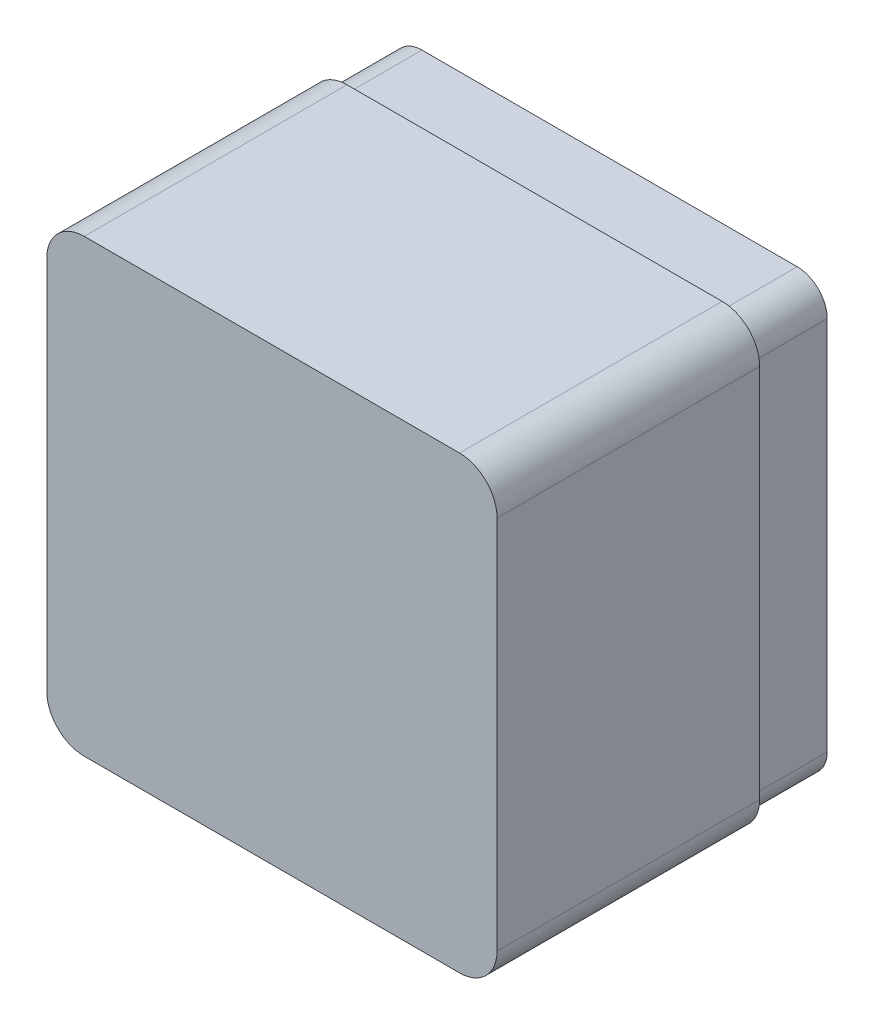
ISO-10303-21;
HEADER;
FILE_DESCRIPTION(('STEP AP214'),'2;1');
FILE_NAME('part.step','',(''),(''),'','','');
FILE_SCHEMA(('AUTOMOTIVE_DESIGN { 1 0 10303 214 1 1 1 1 }'));
ENDSEC;
DATA;
#1=APPLICATION_CONTEXT('core data for automotive mechanical design processes');
#2=APPLICATION_PROTOCOL_DEFINITION('international standard','automotive_design',2000,#1);
#3=PRODUCT_CONTEXT('',#1,'mechanical');
#4=PRODUCT('Part','Part','',(#3));
#5=PRODUCT_RELATED_PRODUCT_CATEGORY('part','',(#4));
#6=PRODUCT_DEFINITION_FORMATION('','',#4);
#7=PRODUCT_DEFINITION_CONTEXT('part definition',#1,'design');
#8=PRODUCT_DEFINITION('design','',#6,#7);
#9=PRODUCT_DEFINITION_SHAPE('','',#8);
#10=(LENGTH_UNIT() NAMED_UNIT(*) SI_UNIT(.MILLI.,.METRE.));
#11=(NAMED_UNIT(*) PLANE_ANGLE_UNIT() SI_UNIT($,.RADIAN.));
#12=(NAMED_UNIT(*) SI_UNIT($,.STERADIAN.) SOLID_ANGLE_UNIT());
#13=UNCERTAINTY_MEASURE_WITH_UNIT(LENGTH_MEASURE(1.E-05),#10,'distance_accuracy_value','');
#14=(GEOMETRIC_REPRESENTATION_CONTEXT(3) GLOBAL_UNCERTAINTY_ASSIGNED_CONTEXT((#13)) GLOBAL_UNIT_ASSIGNED_CONTEXT((#10,
#11,#12)) REPRESENTATION_CONTEXT('',''));
#15=CARTESIAN_POINT('',(0.,0.,0.));
#16=DIRECTION('',(0.,0.,1.));
#17=DIRECTION('',(1.,0.,0.));
#18=AXIS2_PLACEMENT_3D('',#15,#16,#17);
#19=CARTESIAN_POINT('',(0.,0.,0.));
#20=DIRECTION('',(0.,0.,1.));
#21=DIRECTION('',(1.,0.,0.));
#22=AXIS2_PLACEMENT_3D('',#19,#20,#21);
#23=PLANE('',#22);
#24=CARTESIAN_POINT('',(110.,-110.,0.));
#25=DIRECTION('',(0.,0.,1.));
#26=DIRECTION('',(1.,0.,0.));
#27=AXIS2_PLACEMENT_3D('',#24,#25,#26);
#28=CIRCLE('',#27,6.);
#29=CARTESIAN_POINT('',(116.,-110.,0.));
#30=VERTEX_POINT('',#29);
#31=CARTESIAN_POINT('',(110.,-116.,0.));
#32=VERTEX_POINT('',#31);
#33=EDGE_CURVE('E364',#30,#32,#28,.F.);
#34=ORIENTED_EDGE('',*,*,#33,.F.);
#35=DIRECTION('',(0.,1.,0.));
#36=VECTOR('',#35,1.);
#37=CARTESIAN_POINT('',(116.,0.,0.));
#38=LINE('',#37,#36);
#39=CARTESIAN_POINT('',(116.,-10.,0.));
#40=VERTEX_POINT('',#39);
#41=EDGE_CURVE('E389',#30,#40,#38,.T.);
#42=ORIENTED_EDGE('',*,*,#41,.T.);
#43=CARTESIAN_POINT('',(110.,-10.,0.));
#44=DIRECTION('',(0.,0.,1.));
#45=DIRECTION('',(1.,0.,0.));
#46=AXIS2_PLACEMENT_3D('',#43,#44,#45);
#47=CIRCLE('',#46,6.);
#48=CARTESIAN_POINT('',(110.,-4.,0.));
#49=VERTEX_POINT('',#48);
#50=EDGE_CURVE('E368',#49,#40,#47,.F.);
#51=ORIENTED_EDGE('',*,*,#50,.F.);
#52=DIRECTION('',(-1.,0.,0.));
#53=VECTOR('',#52,1.);
#54=CARTESIAN_POINT('',(0.,-4.,0.));
#55=LINE('',#54,#53);
#56=CARTESIAN_POINT('',(10.,-4.,0.));
#57=VERTEX_POINT('',#56);
#58=EDGE_CURVE('E331',#49,#57,#55,.T.);
#59=ORIENTED_EDGE('',*,*,#58,.T.);
#60=CARTESIAN_POINT('',(10.,-10.,0.));
#61=DIRECTION('',(0.,0.,1.));
#62=DIRECTION('',(1.,0.,0.));
#63=AXIS2_PLACEMENT_3D('',#60,#61,#62);
#64=CIRCLE('',#63,6.);
#65=CARTESIAN_POINT('',(4.,-10.,0.));
#66=VERTEX_POINT('',#65);
#67=EDGE_CURVE('E382',#66,#57,#64,.F.);
#68=ORIENTED_EDGE('',*,*,#67,.F.);
#69=DIRECTION('',(0.,-1.,0.));
#70=VECTOR('',#69,1.);
#71=CARTESIAN_POINT('',(4.,0.,0.));
#72=LINE('',#71,#70);
#73=CARTESIAN_POINT('',(4.00000000000001,-110.,0.));
#74=VERTEX_POINT('',#73);
#75=EDGE_CURVE('E320',#66,#74,#72,.T.);
#76=ORIENTED_EDGE('',*,*,#75,.T.);
#77=CARTESIAN_POINT('',(10.,-110.,0.));
#78=DIRECTION('',(0.,0.,1.));
#79=DIRECTION('',(1.,0.,0.));
#80=AXIS2_PLACEMENT_3D('',#77,#78,#79);
#81=CIRCLE('',#80,6.);
#82=CARTESIAN_POINT('',(10.,-116.,0.));
#83=VERTEX_POINT('',#82);
#84=EDGE_CURVE('E385',#83,#74,#81,.F.);
#85=ORIENTED_EDGE('',*,*,#84,.F.);
#86=DIRECTION('',(1.,0.,0.));
#87=VECTOR('',#86,1.);
#88=CARTESIAN_POINT('',(0.,-116.,0.));
#89=LINE('',#88,#87);
#90=EDGE_CURVE('E381',#83,#32,#89,.T.);
#91=ORIENTED_EDGE('',*,*,#90,.T.);
#92=EDGE_LOOP('',(#34,#42,#51,#59,#68,#76,#85,#91));
#93=FACE_BOUND('',#92,.T.);
#94=CARTESIAN_POINT('',(110.,-10.,0.));
#95=DIRECTION('',(0.,0.,-1.));
#96=DIRECTION('',(-1.,0.,0.));
#97=AXIS2_PLACEMENT_3D('',#94,#95,#96);
#98=CIRCLE('',#97,8.);
#99=CARTESIAN_POINT('',(110.,-2.,0.));
#100=VERTEX_POINT('',#99);
#101=CARTESIAN_POINT('',(118.,-10.,0.));
#102=VERTEX_POINT('',#101);
#103=EDGE_CURVE('E256',#100,#102,#98,.T.);
#104=ORIENTED_EDGE('',*,*,#103,.T.);
#105=DIRECTION('',(0.,-1.,0.));
#106=VECTOR('',#105,1.);
#107=CARTESIAN_POINT('',(118.,-10.,0.));
#108=LINE('',#107,#106);
#109=CARTESIAN_POINT('',(118.,-110.,0.));
#110=VERTEX_POINT('',#109);
#111=EDGE_CURVE('E206',#102,#110,#108,.T.);
#112=ORIENTED_EDGE('',*,*,#111,.T.);
#113=CARTESIAN_POINT('',(110.,-110.,0.));
#114=DIRECTION('',(0.,0.,-1.));
#115=DIRECTION('',(-1.,0.,0.));
#116=AXIS2_PLACEMENT_3D('',#113,#114,#115);
#117=CIRCLE('',#116,7.99999999999999);
#118=CARTESIAN_POINT('',(110.,-118.,0.));
#119=VERTEX_POINT('',#118);
#120=EDGE_CURVE('E55',#110,#119,#117,.T.);
#121=ORIENTED_EDGE('',*,*,#120,.T.);
#122=DIRECTION('',(-1.,0.,0.));
#123=VECTOR('',#122,1.);
#124=CARTESIAN_POINT('',(110.,-118.,0.));
#125=LINE('',#124,#123);
#126=CARTESIAN_POINT('',(10.,-118.,0.));
#127=VERTEX_POINT('',#126);
#128=EDGE_CURVE('E263',#119,#127,#125,.T.);
#129=ORIENTED_EDGE('',*,*,#128,.T.);
#130=CARTESIAN_POINT('',(10.,-110.,0.));
#131=DIRECTION('',(0.,0.,-1.));
#132=DIRECTION('',(-1.,0.,0.));
#133=AXIS2_PLACEMENT_3D('',#130,#131,#132);
#134=CIRCLE('',#133,7.99999999999999);
#135=CARTESIAN_POINT('',(2.00000000000002,-110.,0.));
#136=VERTEX_POINT('',#135);
#137=EDGE_CURVE('E267',#127,#136,#134,.T.);
#138=ORIENTED_EDGE('',*,*,#137,.T.);
#139=DIRECTION('',(0.,1.,0.));
#140=VECTOR('',#139,1.);
#141=CARTESIAN_POINT('',(2.00000000000002,-110.,0.));
#142=LINE('',#141,#140);
#143=CARTESIAN_POINT('',(2.00000000000001,-9.99999999999999,0.));
#144=VERTEX_POINT('',#143);
#145=EDGE_CURVE('E271',#136,#144,#142,.T.);
#146=ORIENTED_EDGE('',*,*,#145,.T.);
#147=CARTESIAN_POINT('',(10.,-10.,0.));
#148=DIRECTION('',(0.,0.,-1.));
#149=DIRECTION('',(-1.,0.,0.));
#150=AXIS2_PLACEMENT_3D('',#147,#148,#149);
#151=CIRCLE('',#150,7.99999999999999);
#152=CARTESIAN_POINT('',(10.,-2.,0.));
#153=VERTEX_POINT('',#152);
#154=EDGE_CURVE('E233',#144,#153,#151,.T.);
#155=ORIENTED_EDGE('',*,*,#154,.T.);
#156=DIRECTION('',(1.,0.,0.));
#157=VECTOR('',#156,1.);
#158=CARTESIAN_POINT('',(10.,-2.,0.));
#159=LINE('',#158,#157);
#160=EDGE_CURVE('E229',#153,#100,#159,.T.);
#161=ORIENTED_EDGE('',*,*,#160,.T.);
#162=EDGE_LOOP('',(#104,#112,#121,#129,#138,#146,#155,#161));
#163=FACE_BOUND('',#162,.T.);
#164=ADVANCED_FACE('F39',(#93,#163),#23,.F.);
#165=CARTESIAN_POINT('',(4.,0.,90.));
#166=DIRECTION('',(1.,0.,0.));
#167=DIRECTION('',(0.,1.,0.));
#168=AXIS2_PLACEMENT_3D('',#165,#166,#167);
#169=PLANE('',#168);
#170=ORIENTED_EDGE('',*,*,#75,.F.);
#171=DIRECTION('',(0.,0.,1.));
#172=VECTOR('',#171,1.);
#173=CARTESIAN_POINT('',(4.,-10.,90.));
#174=LINE('',#173,#172);
#175=CARTESIAN_POINT('',(4.,-10.,86.));
#176=VERTEX_POINT('',#175);
#177=EDGE_CURVE('E325',#176,#66,#174,.F.);
#178=ORIENTED_EDGE('',*,*,#177,.F.);
#179=DIRECTION('',(0.,-1.,0.));
#180=VECTOR('',#179,1.);
#181=CARTESIAN_POINT('',(4.,0.,86.));
#182=LINE('',#181,#180);
#183=CARTESIAN_POINT('',(4.00000000000001,-110.,86.));
#184=VERTEX_POINT('',#183);
#185=EDGE_CURVE('E326',#176,#184,#182,.T.);
#186=ORIENTED_EDGE('',*,*,#185,.T.);
#187=DIRECTION('',(0.,0.,1.));
#188=VECTOR('',#187,1.);
#189=CARTESIAN_POINT('',(4.00000000000001,-110.,90.));
#190=LINE('',#189,#188);
#191=EDGE_CURVE('E321',#74,#184,#190,.T.);
#192=ORIENTED_EDGE('',*,*,#191,.F.);
#193=EDGE_LOOP('',(#170,#178,#186,#192));
#194=FACE_BOUND('',#193,.T.);
#195=ADVANCED_FACE('F502',(#194),#169,.T.);
#196=CARTESIAN_POINT('',(0.,-116.,90.));
#197=DIRECTION('',(0.,1.,0.));
#198=DIRECTION('',(0.,0.,1.));
#199=AXIS2_PLACEMENT_3D('',#196,#197,#198);
#200=PLANE('',#199);
#201=ORIENTED_EDGE('',*,*,#90,.F.);
#202=DIRECTION('',(0.,0.,1.));
#203=VECTOR('',#202,1.);
#204=CARTESIAN_POINT('',(10.,-116.,90.));
#205=LINE('',#204,#203);
#206=CARTESIAN_POINT('',(10.,-116.,86.));
#207=VERTEX_POINT('',#206);
#208=EDGE_CURVE('E361',#207,#83,#205,.F.);
#209=ORIENTED_EDGE('',*,*,#208,.F.);
#210=DIRECTION('',(1.,0.,0.));
#211=VECTOR('',#210,1.);
#212=CARTESIAN_POINT('',(0.,-116.,86.));
#213=LINE('',#212,#211);
#214=CARTESIAN_POINT('',(110.,-116.,86.));
#215=VERTEX_POINT('',#214);
#216=EDGE_CURVE('E330',#207,#215,#213,.T.);
#217=ORIENTED_EDGE('',*,*,#216,.T.);
#218=DIRECTION('',(0.,0.,1.));
#219=VECTOR('',#218,1.);
#220=CARTESIAN_POINT('',(110.,-116.,90.));
#221=LINE('',#220,#219);
#222=EDGE_CURVE('E350',#32,#215,#221,.T.);
#223=ORIENTED_EDGE('',*,*,#222,.F.);
#224=EDGE_LOOP('',(#201,#209,#217,#223));
#225=FACE_BOUND('',#224,.T.);
#226=ADVANCED_FACE('F507',(#225),#200,.T.);
#227=CARTESIAN_POINT('',(116.,0.,90.));
#228=DIRECTION('',(-1.,0.,0.));
#229=DIRECTION('',(0.,-1.,0.));
#230=AXIS2_PLACEMENT_3D('',#227,#228,#229);
#231=PLANE('',#230);
#232=DIRECTION('',(0.,1.,0.));
#233=VECTOR('',#232,1.);
#234=CARTESIAN_POINT('',(116.,0.,86.));
#235=LINE('',#234,#233);
#236=CARTESIAN_POINT('',(116.,-110.,86.));
#237=VERTEX_POINT('',#236);
#238=CARTESIAN_POINT('',(116.,-10.,86.));
#239=VERTEX_POINT('',#238);
#240=EDGE_CURVE('E338',#237,#239,#235,.T.);
#241=ORIENTED_EDGE('',*,*,#240,.T.);
#242=DIRECTION('',(0.,0.,1.));
#243=VECTOR('',#242,1.);
#244=CARTESIAN_POINT('',(116.,-10.,90.));
#245=LINE('',#244,#243);
#246=EDGE_CURVE('E354',#40,#239,#245,.T.);
#247=ORIENTED_EDGE('',*,*,#246,.F.);
#248=ORIENTED_EDGE('',*,*,#41,.F.);
#249=DIRECTION('',(0.,0.,1.));
#250=VECTOR('',#249,1.);
#251=CARTESIAN_POINT('',(116.,-110.,90.));
#252=LINE('',#251,#250);
#253=EDGE_CURVE('E365',#237,#30,#252,.F.);
#254=ORIENTED_EDGE('',*,*,#253,.F.);
#255=EDGE_LOOP('',(#241,#247,#248,#254));
#256=FACE_BOUND('',#255,.T.);
#257=ADVANCED_FACE('F681',(#256),#231,.T.);
#258=CARTESIAN_POINT('',(0.,-4.,90.));
#259=DIRECTION('',(0.,-1.,0.));
#260=DIRECTION('',(0.,0.,-1.));
#261=AXIS2_PLACEMENT_3D('',#258,#259,#260);
#262=PLANE('',#261);
#263=ORIENTED_EDGE('',*,*,#58,.F.);
#264=DIRECTION('',(0.,0.,-1.));
#265=VECTOR('',#264,1.);
#266=CARTESIAN_POINT('',(110.,-4.,90.));
#267=LINE('',#266,#265);
#268=CARTESIAN_POINT('',(110.,-4.,86.));
#269=VERTEX_POINT('',#268);
#270=EDGE_CURVE('E324',#269,#49,#267,.T.);
#271=ORIENTED_EDGE('',*,*,#270,.F.);
#272=DIRECTION('',(-1.,0.,0.));
#273=VECTOR('',#272,1.);
#274=CARTESIAN_POINT('',(0.,-4.,86.));
#275=LINE('',#274,#273);
#276=CARTESIAN_POINT('',(10.,-4.,86.));
#277=VERTEX_POINT('',#276);
#278=EDGE_CURVE('E345',#269,#277,#275,.T.);
#279=ORIENTED_EDGE('',*,*,#278,.T.);
#280=DIRECTION('',(0.,0.,-1.));
#281=VECTOR('',#280,1.);
#282=CARTESIAN_POINT('',(10.,-4.,90.));
#283=LINE('',#282,#281);
#284=EDGE_CURVE('E374',#57,#277,#283,.F.);
#285=ORIENTED_EDGE('',*,*,#284,.F.);
#286=EDGE_LOOP('',(#263,#271,#279,#285));
#287=FACE_BOUND('',#286,.T.);
#288=ADVANCED_FACE('F671',(#287),#262,.T.);
#289=CARTESIAN_POINT('',(0.,0.,86.));
#290=DIRECTION('',(0.,0.,1.));
#291=DIRECTION('',(1.,0.,0.));
#292=AXIS2_PLACEMENT_3D('',#289,#290,#291);
#293=PLANE('',#292);
#294=ORIENTED_EDGE('',*,*,#216,.F.);
#295=CARTESIAN_POINT('',(10.,-110.,86.));
#296=DIRECTION('',(0.,0.,1.));
#297=DIRECTION('',(1.,0.,0.));
#298=AXIS2_PLACEMENT_3D('',#295,#296,#297);
#299=CIRCLE('',#298,6.);
#300=EDGE_CURVE('E341',#184,#207,#299,.T.);
#301=ORIENTED_EDGE('',*,*,#300,.F.);
#302=ORIENTED_EDGE('',*,*,#185,.F.);
#303=CARTESIAN_POINT('',(10.,-10.,86.));
#304=DIRECTION('',(0.,0.,1.));
#305=DIRECTION('',(1.,0.,0.));
#306=AXIS2_PLACEMENT_3D('',#303,#304,#305);
#307=CIRCLE('',#306,6.);
#308=EDGE_CURVE('E349',#277,#176,#307,.T.);
#309=ORIENTED_EDGE('',*,*,#308,.F.);
#310=ORIENTED_EDGE('',*,*,#278,.F.);
#311=CARTESIAN_POINT('',(110.,-10.,86.));
#312=DIRECTION('',(0.,0.,1.));
#313=DIRECTION('',(1.,0.,0.));
#314=AXIS2_PLACEMENT_3D('',#311,#312,#313);
#315=CIRCLE('',#314,6.);
#316=EDGE_CURVE('E346',#239,#269,#315,.T.);
#317=ORIENTED_EDGE('',*,*,#316,.F.);
#318=ORIENTED_EDGE('',*,*,#240,.F.);
#319=CARTESIAN_POINT('',(110.,-110.,86.));
#320=DIRECTION('',(0.,0.,1.));
#321=DIRECTION('',(1.,0.,0.));
#322=AXIS2_PLACEMENT_3D('',#319,#320,#321);
#323=CIRCLE('',#322,6.);
#324=EDGE_CURVE('E334',#215,#237,#323,.T.);
#325=ORIENTED_EDGE('',*,*,#324,.F.);
#326=EDGE_LOOP('',(#294,#301,#302,#309,#310,#317,#318,#325));
#327=FACE_BOUND('',#326,.T.);
#328=ADVANCED_FACE('F661',(#327),#293,.F.);
#329=CARTESIAN_POINT('',(110.,-110.,90.));
#330=DIRECTION('',(0.,0.,-1.));
#331=DIRECTION('',(-1.,0.,0.));
#332=AXIS2_PLACEMENT_3D('',#329,#330,#331);
#333=CYLINDRICAL_SURFACE('',#332,6.);
#334=ORIENTED_EDGE('',*,*,#324,.T.);
#335=ORIENTED_EDGE('',*,*,#253,.T.);
#336=ORIENTED_EDGE('',*,*,#33,.T.);
#337=ORIENTED_EDGE('',*,*,#222,.T.);
#338=EDGE_LOOP('',(#334,#335,#336,#337));
#339=FACE_BOUND('',#338,.T.);
#340=ADVANCED_FACE('F651',(#339),#333,.F.);
#341=CARTESIAN_POINT('',(10.,-110.,90.));
#342=DIRECTION('',(0.,0.,-1.));
#343=DIRECTION('',(-1.,0.,0.));
#344=AXIS2_PLACEMENT_3D('',#341,#342,#343);
#345=CYLINDRICAL_SURFACE('',#344,6.);
#346=ORIENTED_EDGE('',*,*,#300,.T.);
#347=ORIENTED_EDGE('',*,*,#208,.T.);
#348=ORIENTED_EDGE('',*,*,#84,.T.);
#349=ORIENTED_EDGE('',*,*,#191,.T.);
#350=EDGE_LOOP('',(#346,#347,#348,#349));
#351=FACE_BOUND('',#350,.T.);
#352=ADVANCED_FACE('F641',(#351),#345,.F.);
#353=CARTESIAN_POINT('',(10.,-10.,90.));
#354=DIRECTION('',(0.,0.,-1.));
#355=DIRECTION('',(-1.,0.,0.));
#356=AXIS2_PLACEMENT_3D('',#353,#354,#355);
#357=CYLINDRICAL_SURFACE('',#356,6.);
#358=ORIENTED_EDGE('',*,*,#308,.T.);
#359=ORIENTED_EDGE('',*,*,#177,.T.);
#360=ORIENTED_EDGE('',*,*,#67,.T.);
#361=ORIENTED_EDGE('',*,*,#284,.T.);
#362=EDGE_LOOP('',(#358,#359,#360,#361));
#363=FACE_BOUND('',#362,.T.);
#364=ADVANCED_FACE('F632',(#363),#357,.F.);
#365=CARTESIAN_POINT('',(110.,-10.,90.));
#366=DIRECTION('',(0.,0.,-1.));
#367=DIRECTION('',(-1.,0.,0.));
#368=AXIS2_PLACEMENT_3D('',#365,#366,#367);
#369=CYLINDRICAL_SURFACE('',#368,6.);
#370=ORIENTED_EDGE('',*,*,#316,.T.);
#371=ORIENTED_EDGE('',*,*,#270,.T.);
#372=ORIENTED_EDGE('',*,*,#50,.T.);
#373=ORIENTED_EDGE('',*,*,#246,.T.);
#374=EDGE_LOOP('',(#370,#371,#372,#373));
#375=FACE_BOUND('',#374,.T.);
#376=ADVANCED_FACE('F617',(#375),#369,.F.);
#377=CARTESIAN_POINT('',(110.,-10.,20.));
#378=DIRECTION('',(0.,0.,-1.));
#379=DIRECTION('',(-1.,0.,0.));
#380=AXIS2_PLACEMENT_3D('',#377,#378,#379);
#381=PLANE('',#380);
#382=DIRECTION('',(1.,0.,0.));
#383=VECTOR('',#382,1.);
#384=CARTESIAN_POINT('',(10.,-2.,20.));
#385=LINE('',#384,#383);
#386=CARTESIAN_POINT('',(10.,-2.,20.));
#387=VERTEX_POINT('',#386);
#388=CARTESIAN_POINT('',(110.,-2.,20.));
#389=VERTEX_POINT('',#388);
#390=EDGE_CURVE('E213',#387,#389,#385,.T.);
#391=ORIENTED_EDGE('',*,*,#390,.F.);
#392=CARTESIAN_POINT('',(10.,-10.,20.));
#393=DIRECTION('',(0.,0.,-1.));
#394=DIRECTION('',(-1.,0.,0.));
#395=AXIS2_PLACEMENT_3D('',#392,#393,#394);
#396=CIRCLE('',#395,7.99999999999999);
#397=CARTESIAN_POINT('',(2.00000000000001,-9.99999999999999,20.));
#398=VERTEX_POINT('',#397);
#399=EDGE_CURVE('E250',#398,#387,#396,.T.);
#400=ORIENTED_EDGE('',*,*,#399,.F.);
#401=DIRECTION('',(0.,1.,0.));
#402=VECTOR('',#401,1.);
#403=CARTESIAN_POINT('',(2.00000000000002,-110.,20.));
#404=LINE('',#403,#402);
#405=CARTESIAN_POINT('',(2.00000000000002,-110.,20.));
#406=VERTEX_POINT('',#405);
#407=EDGE_CURVE('E246',#406,#398,#404,.T.);
#408=ORIENTED_EDGE('',*,*,#407,.F.);
#409=CARTESIAN_POINT('',(10.,-110.,20.));
#410=DIRECTION('',(0.,0.,-1.));
#411=DIRECTION('',(-1.,0.,0.));
#412=AXIS2_PLACEMENT_3D('',#409,#410,#411);
#413=CIRCLE('',#412,7.99999999999999);
#414=CARTESIAN_POINT('',(10.,-118.,20.));
#415=VERTEX_POINT('',#414);
#416=EDGE_CURVE('E242',#415,#406,#413,.T.);
#417=ORIENTED_EDGE('',*,*,#416,.F.);
#418=DIRECTION('',(-1.,0.,0.));
#419=VECTOR('',#418,1.);
#420=CARTESIAN_POINT('',(110.,-118.,20.));
#421=LINE('',#420,#419);
#422=CARTESIAN_POINT('',(110.,-118.,20.));
#423=VERTEX_POINT('',#422);
#424=EDGE_CURVE('E238',#423,#415,#421,.T.);
#425=ORIENTED_EDGE('',*,*,#424,.F.);
#426=CARTESIAN_POINT('',(110.,-110.,20.));
#427=DIRECTION('',(0.,0.,-1.));
#428=DIRECTION('',(-1.,0.,0.));
#429=AXIS2_PLACEMENT_3D('',#426,#427,#428);
#430=CIRCLE('',#429,7.99999999999999);
#431=CARTESIAN_POINT('',(118.,-110.,20.));
#432=VERTEX_POINT('',#431);
#433=EDGE_CURVE('E223',#432,#423,#430,.T.);
#434=ORIENTED_EDGE('',*,*,#433,.F.);
#435=DIRECTION('',(0.,-1.,0.));
#436=VECTOR('',#435,1.);
#437=CARTESIAN_POINT('',(118.,-10.,20.));
#438=LINE('',#437,#436);
#439=CARTESIAN_POINT('',(118.,-10.,20.));
#440=VERTEX_POINT('',#439);
#441=EDGE_CURVE('E204',#440,#432,#438,.T.);
#442=ORIENTED_EDGE('',*,*,#441,.F.);
#443=CARTESIAN_POINT('',(110.,-10.,20.));
#444=DIRECTION('',(0.,0.,-1.));
#445=DIRECTION('',(-1.,0.,0.));
#446=AXIS2_PLACEMENT_3D('',#443,#444,#445);
#447=CIRCLE('',#446,8.);
#448=EDGE_CURVE('E219',#389,#440,#447,.T.);
#449=ORIENTED_EDGE('',*,*,#448,.F.);
#450=EDGE_LOOP('',(#391,#400,#408,#417,#425,#434,#442,#449));
#451=FACE_BOUND('',#450,.T.);
#452=CARTESIAN_POINT('',(110.,-10.,20.));
#453=DIRECTION('',(0.,0.,-1.));
#454=DIRECTION('',(-1.,0.,0.));
#455=AXIS2_PLACEMENT_3D('',#452,#453,#454);
#456=CIRCLE('',#455,10.);
#457=CARTESIAN_POINT('',(110.,0.,20.));
#458=VERTEX_POINT('',#457);
#459=CARTESIAN_POINT('',(120.,-10.,20.));
#460=VERTEX_POINT('',#459);
#461=EDGE_CURVE('E280',#458,#460,#456,.T.);
#462=ORIENTED_EDGE('',*,*,#461,.T.);
#463=DIRECTION('',(0.,-1.,0.));
#464=VECTOR('',#463,1.);
#465=CARTESIAN_POINT('',(120.,-10.,20.));
#466=LINE('',#465,#464);
#467=CARTESIAN_POINT('',(120.,-110.,20.));
#468=VERTEX_POINT('',#467);
#469=EDGE_CURVE('E300',#460,#468,#466,.T.);
#470=ORIENTED_EDGE('',*,*,#469,.T.);
#471=CARTESIAN_POINT('',(110.,-110.,20.));
#472=DIRECTION('',(0.,0.,-1.));
#473=DIRECTION('',(-1.,0.,0.));
#474=AXIS2_PLACEMENT_3D('',#471,#472,#473);
#475=CIRCLE('',#474,9.99999999999999);
#476=CARTESIAN_POINT('',(110.,-120.,20.));
#477=VERTEX_POINT('',#476);
#478=EDGE_CURVE('E303',#468,#477,#475,.T.);
#479=ORIENTED_EDGE('',*,*,#478,.T.);
#480=DIRECTION('',(-1.,0.,0.));
#481=VECTOR('',#480,1.);
#482=CARTESIAN_POINT('',(110.,-120.,20.));
#483=LINE('',#482,#481);
#484=CARTESIAN_POINT('',(10.,-120.,20.));
#485=VERTEX_POINT('',#484);
#486=EDGE_CURVE('E306',#477,#485,#483,.T.);
#487=ORIENTED_EDGE('',*,*,#486,.T.);
#488=CARTESIAN_POINT('',(10.,-110.,20.));
#489=DIRECTION('',(0.,0.,-1.));
#490=DIRECTION('',(-1.,0.,0.));
#491=AXIS2_PLACEMENT_3D('',#488,#489,#490);
#492=CIRCLE('',#491,9.99999999999999);
#493=CARTESIAN_POINT('',(0.,-110.,20.));
#494=VERTEX_POINT('',#493);
#495=EDGE_CURVE('E309',#485,#494,#492,.T.);
#496=ORIENTED_EDGE('',*,*,#495,.T.);
#497=DIRECTION('',(0.,1.,0.));
#498=VECTOR('',#497,1.);
#499=CARTESIAN_POINT('',(0.,-110.,20.));
#500=LINE('',#499,#498);
#501=CARTESIAN_POINT('',(0.,-10.,20.));
#502=VERTEX_POINT('',#501);
#503=EDGE_CURVE('E312',#494,#502,#500,.T.);
#504=ORIENTED_EDGE('',*,*,#503,.T.);
#505=CARTESIAN_POINT('',(10.,-10.,20.));
#506=DIRECTION('',(0.,0.,-1.));
#507=DIRECTION('',(-1.,0.,0.));
#508=AXIS2_PLACEMENT_3D('',#505,#506,#507);
#509=CIRCLE('',#508,10.);
#510=CARTESIAN_POINT('',(10.,0.,20.));
#511=VERTEX_POINT('',#510);
#512=EDGE_CURVE('E315',#502,#511,#509,.T.);
#513=ORIENTED_EDGE('',*,*,#512,.T.);
#514=DIRECTION('',(1.,0.,0.));
#515=VECTOR('',#514,1.);
#516=CARTESIAN_POINT('',(10.,0.,20.));
#517=LINE('',#516,#515);
#518=EDGE_CURVE('E63',#511,#458,#517,.T.);
#519=ORIENTED_EDGE('',*,*,#518,.T.);
#520=EDGE_LOOP('',(#462,#470,#479,#487,#496,#504,#513,#519));
#521=FACE_BOUND('',#520,.T.);
#522=ADVANCED_FACE('F218',(#451,#521),#381,.T.);
#523=CARTESIAN_POINT('',(110.,-10.,20.));
#524=DIRECTION('',(0.,0.,-1.));
#525=DIRECTION('',(-1.,0.,0.));
#526=AXIS2_PLACEMENT_3D('',#523,#524,#525);
#527=CYLINDRICAL_SURFACE('',#526,8.);
#528=ORIENTED_EDGE('',*,*,#103,.F.);
#529=DIRECTION('',(0.,0.,-1.));
#530=VECTOR('',#529,1.);
#531=CARTESIAN_POINT('',(110.,-2.,20.));
#532=LINE('',#531,#530);
#533=EDGE_CURVE('E227',#389,#100,#532,.T.);
#534=ORIENTED_EDGE('',*,*,#533,.F.);
#535=ORIENTED_EDGE('',*,*,#448,.T.);
#536=DIRECTION('',(0.,0.,-1.));
#537=VECTOR('',#536,1.);
#538=CARTESIAN_POINT('',(118.,-10.,20.));
#539=LINE('',#538,#537);
#540=EDGE_CURVE('E201',#440,#102,#539,.T.);
#541=ORIENTED_EDGE('',*,*,#540,.T.);
#542=EDGE_LOOP('',(#528,#534,#535,#541));
#543=FACE_BOUND('',#542,.T.);
#544=ADVANCED_FACE('F226',(#543),#527,.T.);
#545=CARTESIAN_POINT('',(10.,-2.,20.));
#546=DIRECTION('',(0.,1.,0.));
#547=DIRECTION('',(-1.,0.,0.));
#548=AXIS2_PLACEMENT_3D('',#545,#546,#547);
#549=PLANE('',#548);
#550=ORIENTED_EDGE('',*,*,#160,.F.);
#551=DIRECTION('',(0.,0.,-1.));
#552=VECTOR('',#551,1.);
#553=CARTESIAN_POINT('',(10.,-2.,20.));
#554=LINE('',#553,#552);
#555=EDGE_CURVE('E281',#387,#153,#554,.T.);
#556=ORIENTED_EDGE('',*,*,#555,.F.);
#557=ORIENTED_EDGE('',*,*,#390,.T.);
#558=ORIENTED_EDGE('',*,*,#533,.T.);
#559=EDGE_LOOP('',(#550,#556,#557,#558));
#560=FACE_BOUND('',#559,.T.);
#561=ADVANCED_FACE('F591',(#560),#549,.T.);
#562=CARTESIAN_POINT('',(10.,-10.,20.));
#563=DIRECTION('',(0.,0.,-1.));
#564=DIRECTION('',(-1.,0.,0.));
#565=AXIS2_PLACEMENT_3D('',#562,#563,#564);
#566=CYLINDRICAL_SURFACE('',#565,7.99999999999999);
#567=ORIENTED_EDGE('',*,*,#154,.F.);
#568=DIRECTION('',(0.,0.,-1.));
#569=VECTOR('',#568,1.);
#570=CARTESIAN_POINT('',(2.00000000000001,-9.99999999999999,20.));
#571=LINE('',#570,#569);
#572=EDGE_CURVE('E284',#398,#144,#571,.T.);
#573=ORIENTED_EDGE('',*,*,#572,.F.);
#574=ORIENTED_EDGE('',*,*,#399,.T.);
#575=ORIENTED_EDGE('',*,*,#555,.T.);
#576=EDGE_LOOP('',(#567,#573,#574,#575));
#577=FACE_BOUND('',#576,.T.);
#578=ADVANCED_FACE('F581',(#577),#566,.T.);
#579=CARTESIAN_POINT('',(2.00000000000002,-110.,20.));
#580=DIRECTION('',(-1.,0.,0.));
#581=DIRECTION('',(0.,-1.,0.));
#582=AXIS2_PLACEMENT_3D('',#579,#580,#581);
#583=PLANE('',#582);
#584=ORIENTED_EDGE('',*,*,#145,.F.);
#585=DIRECTION('',(0.,0.,-1.));
#586=VECTOR('',#585,1.);
#587=CARTESIAN_POINT('',(2.00000000000002,-110.,20.));
#588=LINE('',#587,#586);
#589=EDGE_CURVE('E287',#406,#136,#588,.T.);
#590=ORIENTED_EDGE('',*,*,#589,.F.);
#591=ORIENTED_EDGE('',*,*,#407,.T.);
#592=ORIENTED_EDGE('',*,*,#572,.T.);
#593=EDGE_LOOP('',(#584,#590,#591,#592));
#594=FACE_BOUND('',#593,.T.);
#595=ADVANCED_FACE('F571',(#594),#583,.T.);
#596=CARTESIAN_POINT('',(10.,-110.,20.));
#597=DIRECTION('',(0.,0.,-1.));
#598=DIRECTION('',(-1.,0.,0.));
#599=AXIS2_PLACEMENT_3D('',#596,#597,#598);
#600=CYLINDRICAL_SURFACE('',#599,7.99999999999999);
#601=ORIENTED_EDGE('',*,*,#137,.F.);
#602=DIRECTION('',(0.,0.,-1.));
#603=VECTOR('',#602,1.);
#604=CARTESIAN_POINT('',(10.,-118.,20.));
#605=LINE('',#604,#603);
#606=EDGE_CURVE('E290',#415,#127,#605,.T.);
#607=ORIENTED_EDGE('',*,*,#606,.F.);
#608=ORIENTED_EDGE('',*,*,#416,.T.);
#609=ORIENTED_EDGE('',*,*,#589,.T.);
#610=EDGE_LOOP('',(#601,#607,#608,#609));
#611=FACE_BOUND('',#610,.T.);
#612=ADVANCED_FACE('F561',(#611),#600,.T.);
#613=CARTESIAN_POINT('',(110.,-118.,20.));
#614=DIRECTION('',(0.,-1.,0.));
#615=DIRECTION('',(0.,0.,-1.));
#616=AXIS2_PLACEMENT_3D('',#613,#614,#615);
#617=PLANE('',#616);
#618=ORIENTED_EDGE('',*,*,#128,.F.);
#619=DIRECTION('',(0.,0.,-1.));
#620=VECTOR('',#619,1.);
#621=CARTESIAN_POINT('',(110.,-118.,20.));
#622=LINE('',#621,#620);
#623=EDGE_CURVE('E293',#423,#119,#622,.T.);
#624=ORIENTED_EDGE('',*,*,#623,.F.);
#625=ORIENTED_EDGE('',*,*,#424,.T.);
#626=ORIENTED_EDGE('',*,*,#606,.T.);
#627=EDGE_LOOP('',(#618,#624,#625,#626));
#628=FACE_BOUND('',#627,.T.);
#629=ADVANCED_FACE('F552',(#628),#617,.T.);
#630=CARTESIAN_POINT('',(110.,-110.,20.));
#631=DIRECTION('',(0.,0.,-1.));
#632=DIRECTION('',(-1.,0.,0.));
#633=AXIS2_PLACEMENT_3D('',#630,#631,#632);
#634=CYLINDRICAL_SURFACE('',#633,7.99999999999999);
#635=ORIENTED_EDGE('',*,*,#120,.F.);
#636=DIRECTION('',(0.,0.,-1.));
#637=VECTOR('',#636,1.);
#638=CARTESIAN_POINT('',(118.,-110.,20.));
#639=LINE('',#638,#637);
#640=EDGE_CURVE('E212',#432,#110,#639,.T.);
#641=ORIENTED_EDGE('',*,*,#640,.F.);
#642=ORIENTED_EDGE('',*,*,#433,.T.);
#643=ORIENTED_EDGE('',*,*,#623,.T.);
#644=EDGE_LOOP('',(#635,#641,#642,#643));
#645=FACE_BOUND('',#644,.T.);
#646=ADVANCED_FACE('F497',(#645),#634,.T.);
#647=CARTESIAN_POINT('',(118.,-10.,20.));
#648=DIRECTION('',(1.,0.,0.));
#649=DIRECTION('',(0.,0.,-1.));
#650=AXIS2_PLACEMENT_3D('',#647,#648,#649);
#651=PLANE('',#650);
#652=ORIENTED_EDGE('',*,*,#111,.F.);
#653=ORIENTED_EDGE('',*,*,#540,.F.);
#654=ORIENTED_EDGE('',*,*,#441,.T.);
#655=ORIENTED_EDGE('',*,*,#640,.T.);
#656=EDGE_LOOP('',(#652,#653,#654,#655));
#657=FACE_BOUND('',#656,.T.);
#658=ADVANCED_FACE('F203',(#657),#651,.T.);
#659=CARTESIAN_POINT('',(0.,0.,90.));
#660=DIRECTION('',(0.,0.,1.));
#661=DIRECTION('',(1.,0.,0.));
#662=AXIS2_PLACEMENT_3D('',#659,#660,#661);
#663=PLANE('',#662);
#664=DIRECTION('',(1.,0.,0.));
#665=VECTOR('',#664,1.);
#666=CARTESIAN_POINT('',(0.,-120.,90.));
#667=LINE('',#666,#665);
#668=CARTESIAN_POINT('',(10.,-120.,90.));
#669=VERTEX_POINT('',#668);
#670=CARTESIAN_POINT('',(110.,-120.,90.));
#671=VERTEX_POINT('',#670);
#672=EDGE_CURVE('E405',#669,#671,#667,.T.);
#673=ORIENTED_EDGE('',*,*,#672,.T.);
#674=CARTESIAN_POINT('',(110.,-110.,90.));
#675=DIRECTION('',(0.,0.,1.));
#676=DIRECTION('',(1.,0.,0.));
#677=AXIS2_PLACEMENT_3D('',#674,#675,#676);
#678=CIRCLE('',#677,10.);
#679=CARTESIAN_POINT('',(120.,-110.,90.));
#680=VERTEX_POINT('',#679);
#681=EDGE_CURVE('E440',#671,#680,#678,.T.);
#682=ORIENTED_EDGE('',*,*,#681,.T.);
#683=DIRECTION('',(0.,1.,0.));
#684=VECTOR('',#683,1.);
#685=CARTESIAN_POINT('',(120.,0.,90.));
#686=LINE('',#685,#684);
#687=CARTESIAN_POINT('',(120.,-10.,90.));
#688=VERTEX_POINT('',#687);
#689=EDGE_CURVE('E409',#680,#688,#686,.T.);
#690=ORIENTED_EDGE('',*,*,#689,.T.);
#691=CARTESIAN_POINT('',(110.,-10.,90.));
#692=DIRECTION('',(0.,0.,1.));
#693=DIRECTION('',(1.,0.,0.));
#694=AXIS2_PLACEMENT_3D('',#691,#692,#693);
#695=CIRCLE('',#694,10.);
#696=CARTESIAN_POINT('',(110.,0.,90.));
#697=VERTEX_POINT('',#696);
#698=EDGE_CURVE('E431',#688,#697,#695,.T.);
#699=ORIENTED_EDGE('',*,*,#698,.T.);
#700=DIRECTION('',(-1.,0.,0.));
#701=VECTOR('',#700,1.);
#702=CARTESIAN_POINT('',(0.,0.,90.));
#703=LINE('',#702,#701);
#704=CARTESIAN_POINT('',(10.,0.,90.));
#705=VERTEX_POINT('',#704);
#706=EDGE_CURVE('E413',#697,#705,#703,.T.);
#707=ORIENTED_EDGE('',*,*,#706,.T.);
#708=CARTESIAN_POINT('',(10.,-10.,90.));
#709=DIRECTION('',(0.,0.,1.));
#710=DIRECTION('',(1.,0.,0.));
#711=AXIS2_PLACEMENT_3D('',#708,#709,#710);
#712=CIRCLE('',#711,10.);
#713=CARTESIAN_POINT('',(0.,-10.,90.));
#714=VERTEX_POINT('',#713);
#715=EDGE_CURVE('E434',#705,#714,#712,.T.);
#716=ORIENTED_EDGE('',*,*,#715,.T.);
#717=DIRECTION('',(0.,-1.,0.));
#718=VECTOR('',#717,1.);
#719=CARTESIAN_POINT('',(0.,0.,90.));
#720=LINE('',#719,#718);
#721=CARTESIAN_POINT('',(0.,-110.,90.));
#722=VERTEX_POINT('',#721);
#723=EDGE_CURVE('E377',#714,#722,#720,.T.);
#724=ORIENTED_EDGE('',*,*,#723,.T.);
#725=CARTESIAN_POINT('',(10.,-110.,90.));
#726=DIRECTION('',(0.,0.,1.));
#727=DIRECTION('',(1.,0.,0.));
#728=AXIS2_PLACEMENT_3D('',#725,#726,#727);
#729=CIRCLE('',#728,10.);
#730=EDGE_CURVE('E437',#722,#669,#729,.T.);
#731=ORIENTED_EDGE('',*,*,#730,.T.);
#732=EDGE_LOOP('',(#673,#682,#690,#699,#707,#716,#724,#731));
#733=FACE_BOUND('',#732,.T.);
#734=ADVANCED_FACE('F489',(#733),#663,.T.);
#735=CARTESIAN_POINT('',(10.,-110.,90.));
#736=DIRECTION('',(0.,0.,-1.));
#737=DIRECTION('',(-1.,0.,0.));
#738=AXIS2_PLACEMENT_3D('',#735,#736,#737);
#739=CYLINDRICAL_SURFACE('',#738,10.);
#740=DIRECTION('',(0.,0.,-1.));
#741=VECTOR('',#740,1.);
#742=CARTESIAN_POINT('',(0.,-110.,90.));
#743=LINE('',#742,#741);
#744=EDGE_CURVE('E447',#494,#722,#743,.F.);
#745=ORIENTED_EDGE('',*,*,#744,.F.);
#746=ORIENTED_EDGE('',*,*,#495,.F.);
#747=DIRECTION('',(0.,0.,-1.));
#748=VECTOR('',#747,1.);
#749=CARTESIAN_POINT('',(10.,-120.,90.));
#750=LINE('',#749,#748);
#751=EDGE_CURVE('E424',#669,#485,#750,.T.);
#752=ORIENTED_EDGE('',*,*,#751,.F.);
#753=ORIENTED_EDGE('',*,*,#730,.F.);
#754=EDGE_LOOP('',(#745,#746,#752,#753));
#755=FACE_BOUND('',#754,.T.);
#756=ADVANCED_FACE('F478',(#755),#739,.T.);
#757=CARTESIAN_POINT('',(110.,-110.,90.));
#758=DIRECTION('',(0.,0.,-1.));
#759=DIRECTION('',(-1.,0.,0.));
#760=AXIS2_PLACEMENT_3D('',#757,#758,#759);
#761=CYLINDRICAL_SURFACE('',#760,10.);
#762=DIRECTION('',(0.,0.,-1.));
#763=VECTOR('',#762,1.);
#764=CARTESIAN_POINT('',(110.,-120.,90.));
#765=LINE('',#764,#763);
#766=EDGE_CURVE('E428',#477,#671,#765,.F.);
#767=ORIENTED_EDGE('',*,*,#766,.F.);
#768=ORIENTED_EDGE('',*,*,#478,.F.);
#769=DIRECTION('',(0.,0.,-1.));
#770=VECTOR('',#769,1.);
#771=CARTESIAN_POINT('',(120.,-110.,90.));
#772=LINE('',#771,#770);
#773=EDGE_CURVE('E420',#680,#468,#772,.T.);
#774=ORIENTED_EDGE('',*,*,#773,.F.);
#775=ORIENTED_EDGE('',*,*,#681,.F.);
#776=EDGE_LOOP('',(#767,#768,#774,#775));
#777=FACE_BOUND('',#776,.T.);
#778=ADVANCED_FACE('F468',(#777),#761,.T.);
#779=CARTESIAN_POINT('',(110.,-10.,90.));
#780=DIRECTION('',(0.,0.,-1.));
#781=DIRECTION('',(-1.,0.,0.));
#782=AXIS2_PLACEMENT_3D('',#779,#780,#781);
#783=CYLINDRICAL_SURFACE('',#782,10.);
#784=DIRECTION('',(0.,0.,-1.));
#785=VECTOR('',#784,1.);
#786=CARTESIAN_POINT('',(120.,-10.,90.));
#787=LINE('',#786,#785);
#788=EDGE_CURVE('E417',#460,#688,#787,.F.);
#789=ORIENTED_EDGE('',*,*,#788,.F.);
#790=ORIENTED_EDGE('',*,*,#461,.F.);
#791=DIRECTION('',(0.,0.,-1.));
#792=VECTOR('',#791,1.);
#793=CARTESIAN_POINT('',(110.,0.,90.));
#794=LINE('',#793,#792);
#795=EDGE_CURVE('E48',#697,#458,#794,.T.);
#796=ORIENTED_EDGE('',*,*,#795,.F.);
#797=ORIENTED_EDGE('',*,*,#698,.F.);
#798=EDGE_LOOP('',(#789,#790,#796,#797));
#799=FACE_BOUND('',#798,.T.);
#800=ADVANCED_FACE('F41',(#799),#783,.T.);
#801=CARTESIAN_POINT('',(10.,-10.,90.));
#802=DIRECTION('',(0.,0.,-1.));
#803=DIRECTION('',(-1.,0.,0.));
#804=AXIS2_PLACEMENT_3D('',#801,#802,#803);
#805=CYLINDRICAL_SURFACE('',#804,10.);
#806=DIRECTION('',(0.,0.,-1.));
#807=VECTOR('',#806,1.);
#808=CARTESIAN_POINT('',(10.,0.,90.));
#809=LINE('',#808,#807);
#810=EDGE_CURVE('E11',#511,#705,#809,.F.);
#811=ORIENTED_EDGE('',*,*,#810,.F.);
#812=ORIENTED_EDGE('',*,*,#512,.F.);
#813=DIRECTION('',(0.,0.,-1.));
#814=VECTOR('',#813,1.);
#815=CARTESIAN_POINT('',(0.,-10.,90.));
#816=LINE('',#815,#814);
#817=EDGE_CURVE('E443',#714,#502,#816,.T.);
#818=ORIENTED_EDGE('',*,*,#817,.F.);
#819=ORIENTED_EDGE('',*,*,#715,.F.);
#820=EDGE_LOOP('',(#811,#812,#818,#819));
#821=FACE_BOUND('',#820,.T.);
#822=ADVANCED_FACE('F487',(#821),#805,.T.);
#823=CARTESIAN_POINT('',(0.,0.,90.));
#824=DIRECTION('',(0.,-1.,0.));
#825=DIRECTION('',(0.,0.,-1.));
#826=AXIS2_PLACEMENT_3D('',#823,#824,#825);
#827=PLANE('',#826);
#828=ORIENTED_EDGE('',*,*,#518,.F.);
#829=ORIENTED_EDGE('',*,*,#810,.T.);
#830=ORIENTED_EDGE('',*,*,#706,.F.);
#831=ORIENTED_EDGE('',*,*,#795,.T.);
#832=EDGE_LOOP('',(#828,#829,#830,#831));
#833=FACE_BOUND('',#832,.T.);
#834=ADVANCED_FACE('F454',(#833),#827,.F.);
#835=CARTESIAN_POINT('',(120.,0.,90.));
#836=DIRECTION('',(-1.,0.,0.));
#837=DIRECTION('',(0.,-1.,0.));
#838=AXIS2_PLACEMENT_3D('',#835,#836,#837);
#839=PLANE('',#838);
#840=ORIENTED_EDGE('',*,*,#469,.F.);
#841=ORIENTED_EDGE('',*,*,#788,.T.);
#842=ORIENTED_EDGE('',*,*,#689,.F.);
#843=ORIENTED_EDGE('',*,*,#773,.T.);
#844=EDGE_LOOP('',(#840,#841,#842,#843));
#845=FACE_BOUND('',#844,.T.);
#846=ADVANCED_FACE('F462',(#845),#839,.F.);
#847=CARTESIAN_POINT('',(0.,-120.,90.));
#848=DIRECTION('',(0.,1.,0.));
#849=DIRECTION('',(0.,0.,1.));
#850=AXIS2_PLACEMENT_3D('',#847,#848,#849);
#851=PLANE('',#850);
#852=ORIENTED_EDGE('',*,*,#486,.F.);
#853=ORIENTED_EDGE('',*,*,#766,.T.);
#854=ORIENTED_EDGE('',*,*,#672,.F.);
#855=ORIENTED_EDGE('',*,*,#751,.T.);
#856=EDGE_LOOP('',(#852,#853,#854,#855));
#857=FACE_BOUND('',#856,.T.);
#858=ADVANCED_FACE('F472',(#857),#851,.F.);
#859=CARTESIAN_POINT('',(0.,0.,90.));
#860=DIRECTION('',(1.,0.,0.));
#861=DIRECTION('',(0.,1.,0.));
#862=AXIS2_PLACEMENT_3D('',#859,#860,#861);
#863=PLANE('',#862);
#864=ORIENTED_EDGE('',*,*,#503,.F.);
#865=ORIENTED_EDGE('',*,*,#744,.T.);
#866=ORIENTED_EDGE('',*,*,#723,.F.);
#867=ORIENTED_EDGE('',*,*,#817,.T.);
#868=EDGE_LOOP('',(#864,#865,#866,#867));
#869=FACE_BOUND('',#868,.T.);
#870=ADVANCED_FACE('F482',(#869),#863,.F.);
#871=CLOSED_SHELL('',(#164,#195,#226,#257,#288,#328,#340,#352,#364,#376,#522,#544,#561,#578,
#595,#612,#629,#646,#658,#734,#756,#778,#800,#822,#834,#846,#858,#870));
#872=MANIFOLD_SOLID_BREP('B2',#871);
#873=ADVANCED_BREP_SHAPE_REPRESENTATION('',(#18,#872),#14);
#874=SHAPE_DEFINITION_REPRESENTATION(#9,#873);
ENDSEC;
END-ISO-10303-21;
